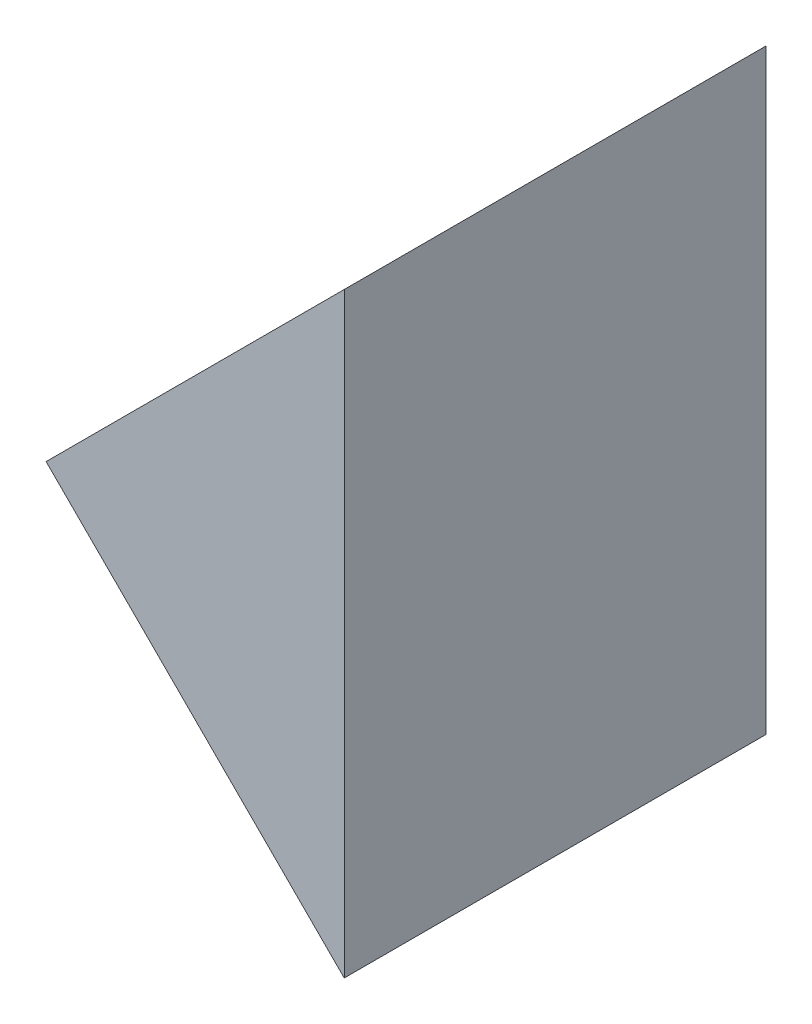
ISO-10303-21;
HEADER;
FILE_DESCRIPTION(('STEP AP214'),'2;1');
FILE_NAME('part.step','',(''),(''),'','','');
FILE_SCHEMA(('AUTOMOTIVE_DESIGN { 1 0 10303 214 1 1 1 1 }'));
ENDSEC;
DATA;
#1=APPLICATION_CONTEXT('core data for automotive mechanical design processes');
#2=APPLICATION_PROTOCOL_DEFINITION('international standard','automotive_design',2000,#1);
#3=PRODUCT_CONTEXT('',#1,'mechanical');
#4=PRODUCT('Part','Part','',(#3));
#5=PRODUCT_RELATED_PRODUCT_CATEGORY('part','',(#4));
#6=PRODUCT_DEFINITION_FORMATION('','',#4);
#7=PRODUCT_DEFINITION_CONTEXT('part definition',#1,'design');
#8=PRODUCT_DEFINITION('design','',#6,#7);
#9=PRODUCT_DEFINITION_SHAPE('','',#8);
#10=(LENGTH_UNIT() NAMED_UNIT(*) SI_UNIT(.MILLI.,.METRE.));
#11=(NAMED_UNIT(*) PLANE_ANGLE_UNIT() SI_UNIT($,.RADIAN.));
#12=(NAMED_UNIT(*) SI_UNIT($,.STERADIAN.) SOLID_ANGLE_UNIT());
#13=UNCERTAINTY_MEASURE_WITH_UNIT(LENGTH_MEASURE(1.E-05),#10,'distance_accuracy_value','');
#14=(GEOMETRIC_REPRESENTATION_CONTEXT(3) GLOBAL_UNCERTAINTY_ASSIGNED_CONTEXT((#13)) GLOBAL_UNIT_ASSIGNED_CONTEXT((#10,
#11,#12)) REPRESENTATION_CONTEXT('',''));
#15=CARTESIAN_POINT('',(0.,0.,0.));
#16=DIRECTION('',(0.,0.,1.));
#17=DIRECTION('',(1.,0.,0.));
#18=AXIS2_PLACEMENT_3D('',#15,#16,#17);
#19=CARTESIAN_POINT('',(55.4766699525949,13.7756925528341,5.));
#20=DIRECTION('',(0.707106781186548,0.707106781186547,0.));
#21=DIRECTION('',(-0.707106781186547,0.707106781186548,0.));
#22=AXIS2_PLACEMENT_3D('',#19,#20,#21);
#23=PLANE('',#22);
#24=DIRECTION('',(0.707106781186547,-0.707106781186548,0.));
#25=VECTOR('',#24,1.);
#26=CARTESIAN_POINT('',(55.4766699525949,13.7756925528341,0.));
#27=LINE('',#26,#25);
#28=CARTESIAN_POINT('',(55.4766699525949,13.7756925528341,0.));
#29=VERTEX_POINT('',#28);
#30=CARTESIAN_POINT('',(59.0122038585277,10.2401586469013,0.));
#31=VERTEX_POINT('',#30);
#32=EDGE_CURVE('E84',#29,#31,#27,.T.);
#33=ORIENTED_EDGE('',*,*,#32,.T.);
#34=DIRECTION('',(0.,0.,-1.));
#35=VECTOR('',#34,1.);
#36=CARTESIAN_POINT('',(59.0122038585277,10.2401586469013,5.));
#37=LINE('',#36,#35);
#38=CARTESIAN_POINT('',(59.0122038585277,10.2401586469013,5.));
#39=VERTEX_POINT('',#38);
#40=EDGE_CURVE('E11',#39,#31,#37,.T.);
#41=ORIENTED_EDGE('',*,*,#40,.F.);
#42=DIRECTION('',(0.707106781186547,-0.707106781186548,0.));
#43=VECTOR('',#42,1.);
#44=CARTESIAN_POINT('',(55.4766699525949,13.7756925528341,5.));
#45=LINE('',#44,#43);
#46=CARTESIAN_POINT('',(55.4766699525949,13.7756925528341,5.));
#47=VERTEX_POINT('',#46);
#48=EDGE_CURVE('E77',#47,#39,#45,.T.);
#49=ORIENTED_EDGE('',*,*,#48,.F.);
#50=DIRECTION('',(0.,0.,-1.));
#51=VECTOR('',#50,1.);
#52=CARTESIAN_POINT('',(55.4766699525949,13.7756925528341,5.));
#53=LINE('',#52,#51);
#54=EDGE_CURVE('E85',#47,#29,#53,.T.);
#55=ORIENTED_EDGE('',*,*,#54,.T.);
#56=EDGE_LOOP('',(#33,#41,#49,#55));
#57=FACE_BOUND('',#56,.T.);
#58=ADVANCED_FACE('F37',(#57),#23,.F.);
#59=CARTESIAN_POINT('',(59.0122038585277,10.2401586469013,5.));
#60=DIRECTION('',(-1.,0.,0.));
#61=DIRECTION('',(0.,-1.,0.));
#62=AXIS2_PLACEMENT_3D('',#59,#60,#61);
#63=PLANE('',#62);
#64=DIRECTION('',(0.,1.,0.));
#65=VECTOR('',#64,1.);
#66=CARTESIAN_POINT('',(59.0122038585277,10.2401586469013,0.));
#67=LINE('',#66,#65);
#68=CARTESIAN_POINT('',(59.0122038585277,17.3112264587668,0.));
#69=VERTEX_POINT('',#68);
#70=EDGE_CURVE('E65',#31,#69,#67,.T.);
#71=ORIENTED_EDGE('',*,*,#70,.T.);
#72=DIRECTION('',(0.,0.,-1.));
#73=VECTOR('',#72,1.);
#74=CARTESIAN_POINT('',(59.0122038585277,17.3112264587668,5.));
#75=LINE('',#74,#73);
#76=CARTESIAN_POINT('',(59.0122038585277,17.3112264587668,5.));
#77=VERTEX_POINT('',#76);
#78=EDGE_CURVE('E45',#77,#69,#75,.T.);
#79=ORIENTED_EDGE('',*,*,#78,.F.);
#80=DIRECTION('',(0.,1.,0.));
#81=VECTOR('',#80,1.);
#82=CARTESIAN_POINT('',(59.0122038585277,10.2401586469013,5.));
#83=LINE('',#82,#81);
#84=EDGE_CURVE('E73',#39,#77,#83,.T.);
#85=ORIENTED_EDGE('',*,*,#84,.F.);
#86=ORIENTED_EDGE('',*,*,#40,.T.);
#87=EDGE_LOOP('',(#71,#79,#85,#86));
#88=FACE_BOUND('',#87,.T.);
#89=ADVANCED_FACE('F74',(#88),#63,.F.);
#90=CARTESIAN_POINT('',(55.4766699525949,13.7756925528341,5.));
#91=DIRECTION('',(0.707106781186546,-0.707106781186549,0.));
#92=DIRECTION('',(0.707106781186549,0.707106781186546,0.));
#93=AXIS2_PLACEMENT_3D('',#90,#91,#92);
#94=PLANE('',#93);
#95=DIRECTION('',(-0.707106781186549,-0.707106781186546,0.));
#96=VECTOR('',#95,1.);
#97=CARTESIAN_POINT('',(55.4766699525949,13.7756925528341,0.));
#98=LINE('',#97,#96);
#99=EDGE_CURVE('E70',#69,#29,#98,.T.);
#100=ORIENTED_EDGE('',*,*,#99,.T.);
#101=ORIENTED_EDGE('',*,*,#54,.F.);
#102=DIRECTION('',(-0.707106781186549,-0.707106781186546,0.));
#103=VECTOR('',#102,1.);
#104=CARTESIAN_POINT('',(55.4766699525949,13.7756925528341,5.));
#105=LINE('',#104,#103);
#106=EDGE_CURVE('E53',#77,#47,#105,.T.);
#107=ORIENTED_EDGE('',*,*,#106,.F.);
#108=ORIENTED_EDGE('',*,*,#78,.T.);
#109=EDGE_LOOP('',(#100,#101,#107,#108));
#110=FACE_BOUND('',#109,.T.);
#111=ADVANCED_FACE('F92',(#110),#94,.F.);
#112=CARTESIAN_POINT('',(0.,0.,5.));
#113=DIRECTION('',(0.,0.,1.));
#114=DIRECTION('',(1.,0.,0.));
#115=AXIS2_PLACEMENT_3D('',#112,#113,#114);
#116=PLANE('',#115);
#117=ORIENTED_EDGE('',*,*,#48,.T.);
#118=ORIENTED_EDGE('',*,*,#84,.T.);
#119=ORIENTED_EDGE('',*,*,#106,.T.);
#120=EDGE_LOOP('',(#117,#118,#119));
#121=FACE_BOUND('',#120,.T.);
#122=ADVANCED_FACE('F80',(#121),#116,.T.);
#123=CARTESIAN_POINT('',(0.,0.,0.));
#124=DIRECTION('',(0.,0.,1.));
#125=DIRECTION('',(1.,0.,0.));
#126=AXIS2_PLACEMENT_3D('',#123,#124,#125);
#127=PLANE('',#126);
#128=ORIENTED_EDGE('',*,*,#32,.F.);
#129=ORIENTED_EDGE('',*,*,#99,.F.);
#130=ORIENTED_EDGE('',*,*,#70,.F.);
#131=EDGE_LOOP('',(#128,#129,#130));
#132=FACE_BOUND('',#131,.T.);
#133=ADVANCED_FACE('F93',(#132),#127,.F.);
#134=CLOSED_SHELL('',(#58,#89,#111,#122,#133));
#135=MANIFOLD_SOLID_BREP('B2',#134);
#136=ADVANCED_BREP_SHAPE_REPRESENTATION('',(#18,#135),#14);
#137=SHAPE_DEFINITION_REPRESENTATION(#9,#136);
ENDSEC;
END-ISO-10303-21;
